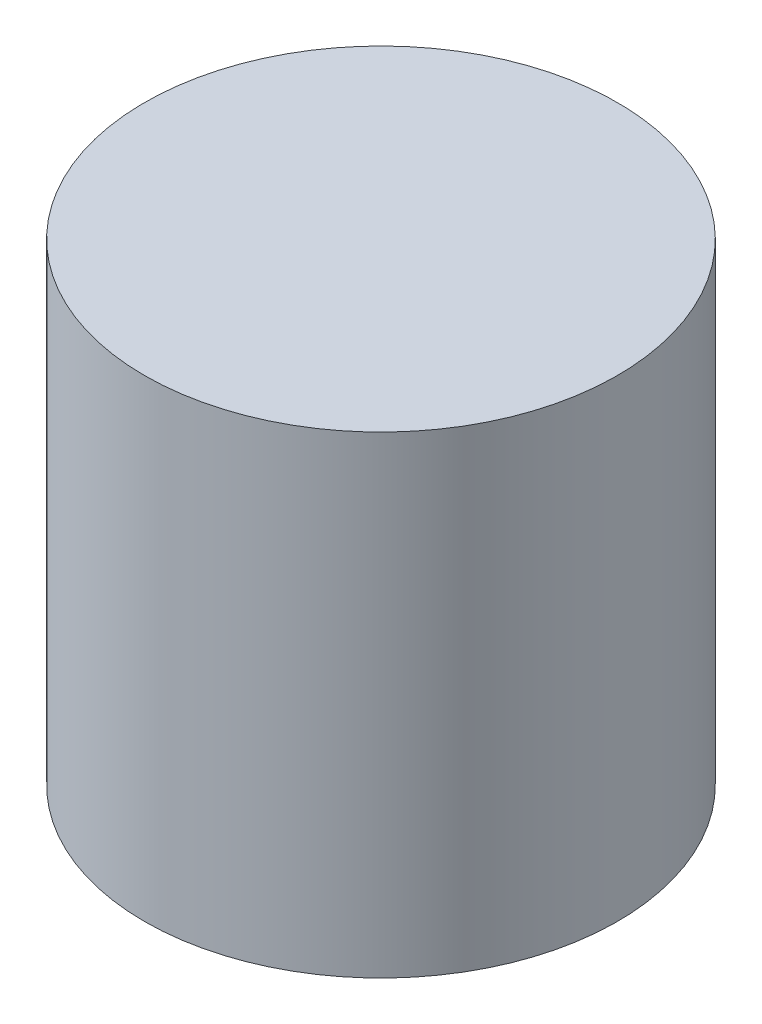
ISO-10303-21;
HEADER;
FILE_DESCRIPTION(('STEP AP214'),'2;1');
FILE_NAME('part.step','',(''),(''),'','','');
FILE_SCHEMA(('AUTOMOTIVE_DESIGN { 1 0 10303 214 1 1 1 1 }'));
ENDSEC;
DATA;
#1=APPLICATION_CONTEXT('core data for automotive mechanical design processes');
#2=APPLICATION_PROTOCOL_DEFINITION('international standard','automotive_design',2000,#1);
#3=PRODUCT_CONTEXT('',#1,'mechanical');
#4=PRODUCT('Part','Part','',(#3));
#5=PRODUCT_RELATED_PRODUCT_CATEGORY('part','',(#4));
#6=PRODUCT_DEFINITION_FORMATION('','',#4);
#7=PRODUCT_DEFINITION_CONTEXT('part definition',#1,'design');
#8=PRODUCT_DEFINITION('design','',#6,#7);
#9=PRODUCT_DEFINITION_SHAPE('','',#8);
#10=(LENGTH_UNIT() NAMED_UNIT(*) SI_UNIT(.MILLI.,.METRE.));
#11=(NAMED_UNIT(*) PLANE_ANGLE_UNIT() SI_UNIT($,.RADIAN.));
#12=(NAMED_UNIT(*) SI_UNIT($,.STERADIAN.) SOLID_ANGLE_UNIT());
#13=UNCERTAINTY_MEASURE_WITH_UNIT(LENGTH_MEASURE(1.E-05),#10,'distance_accuracy_value','');
#14=(GEOMETRIC_REPRESENTATION_CONTEXT(3) GLOBAL_UNCERTAINTY_ASSIGNED_CONTEXT((#13)) GLOBAL_UNIT_ASSIGNED_CONTEXT((#10,
#11,#12)) REPRESENTATION_CONTEXT('',''));
#15=CARTESIAN_POINT('',(0.,0.,0.));
#16=DIRECTION('',(0.,0.,1.));
#17=DIRECTION('',(1.,0.,0.));
#18=AXIS2_PLACEMENT_3D('',#15,#16,#17);
#19=CARTESIAN_POINT('',(0.,15.,0.));
#20=DIRECTION('',(0.,-1.,0.));
#21=DIRECTION('',(0.,0.,-1.));
#22=AXIS2_PLACEMENT_3D('',#19,#20,#21);
#23=CYLINDRICAL_SURFACE('',#22,7.5);
#24=CARTESIAN_POINT('',(0.,15.,0.));
#25=DIRECTION('',(0.,1.,0.));
#26=DIRECTION('',(0.,0.,1.));
#27=AXIS2_PLACEMENT_3D('',#24,#25,#26);
#28=CIRCLE('',#27,7.5);
#29=CARTESIAN_POINT('',(0.,15.,7.5));
#30=VERTEX_POINT('',#29);
#31=EDGE_CURVE('E10',#30,#30,#28,.T.);
#32=ORIENTED_EDGE('',*,*,#31,.F.);
#33=EDGE_LOOP('',(#32));
#34=FACE_BOUND('',#33,.T.);
#35=CARTESIAN_POINT('',(0.,0.,0.));
#36=DIRECTION('',(0.,1.,0.));
#37=DIRECTION('',(0.,0.,1.));
#38=AXIS2_PLACEMENT_3D('',#35,#36,#37);
#39=CIRCLE('',#38,7.5);
#40=CARTESIAN_POINT('',(0.,0.,7.5));
#41=VERTEX_POINT('',#40);
#42=EDGE_CURVE('E36',#41,#41,#39,.T.);
#43=ORIENTED_EDGE('',*,*,#42,.T.);
#44=EDGE_LOOP('',(#43));
#45=FACE_BOUND('',#44,.T.);
#46=ADVANCED_FACE('F33',(#34,#45),#23,.T.);
#47=CARTESIAN_POINT('',(0.,15.,0.));
#48=DIRECTION('',(0.,1.,0.));
#49=DIRECTION('',(0.,0.,1.));
#50=AXIS2_PLACEMENT_3D('',#47,#48,#49);
#51=PLANE('',#50);
#52=ORIENTED_EDGE('',*,*,#31,.T.);
#53=EDGE_LOOP('',(#52));
#54=FACE_BOUND('',#53,.T.);
#55=ADVANCED_FACE('F48',(#54),#51,.T.);
#56=CARTESIAN_POINT('',(0.,0.,0.));
#57=DIRECTION('',(0.,1.,0.));
#58=DIRECTION('',(0.,0.,1.));
#59=AXIS2_PLACEMENT_3D('',#56,#57,#58);
#60=PLANE('',#59);
#61=ORIENTED_EDGE('',*,*,#42,.F.);
#62=EDGE_LOOP('',(#61));
#63=FACE_BOUND('',#62,.T.);
#64=ADVANCED_FACE('F46',(#63),#60,.F.);
#65=CLOSED_SHELL('',(#46,#55,#64));
#66=MANIFOLD_SOLID_BREP('B2',#65);
#67=ADVANCED_BREP_SHAPE_REPRESENTATION('',(#18,#66),#14);
#68=SHAPE_DEFINITION_REPRESENTATION(#9,#67);
ENDSEC;
END-ISO-10303-21;
